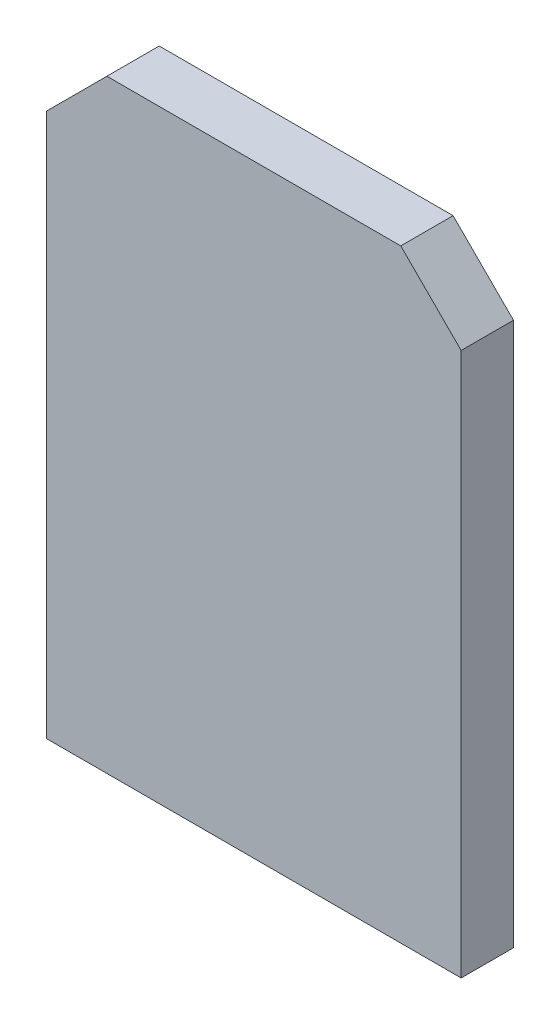
ISO-10303-21;
HEADER;
FILE_DESCRIPTION(('STEP AP214'),'2;1');
FILE_NAME('part.step','',(''),(''),'','','');
FILE_SCHEMA(('AUTOMOTIVE_DESIGN { 1 0 10303 214 1 1 1 1 }'));
ENDSEC;
DATA;
#1=APPLICATION_CONTEXT('core data for automotive mechanical design processes');
#2=APPLICATION_PROTOCOL_DEFINITION('international standard','automotive_design',2000,#1);
#3=PRODUCT_CONTEXT('',#1,'mechanical');
#4=PRODUCT('Part','Part','',(#3));
#5=PRODUCT_RELATED_PRODUCT_CATEGORY('part','',(#4));
#6=PRODUCT_DEFINITION_FORMATION('','',#4);
#7=PRODUCT_DEFINITION_CONTEXT('part definition',#1,'design');
#8=PRODUCT_DEFINITION('design','',#6,#7);
#9=PRODUCT_DEFINITION_SHAPE('','',#8);
#10=(LENGTH_UNIT() NAMED_UNIT(*) SI_UNIT(.MILLI.,.METRE.));
#11=(NAMED_UNIT(*) PLANE_ANGLE_UNIT() SI_UNIT($,.RADIAN.));
#12=(NAMED_UNIT(*) SI_UNIT($,.STERADIAN.) SOLID_ANGLE_UNIT());
#13=UNCERTAINTY_MEASURE_WITH_UNIT(LENGTH_MEASURE(1.E-05),#10,'distance_accuracy_value','');
#14=(GEOMETRIC_REPRESENTATION_CONTEXT(3) GLOBAL_UNCERTAINTY_ASSIGNED_CONTEXT((#13)) GLOBAL_UNIT_ASSIGNED_CONTEXT((#10,
#11,#12)) REPRESENTATION_CONTEXT('',''));
#15=CARTESIAN_POINT('',(0.,0.,0.));
#16=DIRECTION('',(0.,0.,1.));
#17=DIRECTION('',(1.,0.,0.));
#18=AXIS2_PLACEMENT_3D('',#15,#16,#17);
#19=CARTESIAN_POINT('',(-8.94626791893227,-3.08007909045971,1.3));
#20=DIRECTION('',(0.707106781186548,-0.707106781186548,0.));
#21=DIRECTION('',(0.707106781186548,0.707106781186548,0.));
#22=AXIS2_PLACEMENT_3D('',#19,#20,#21);
#23=PLANE('',#22);
#24=DIRECTION('',(-0.707106781186548,-0.707106781186548,0.));
#25=VECTOR('',#24,1.);
#26=CARTESIAN_POINT('',(-8.94626791893227,-3.08007909045971,0.));
#27=LINE('',#26,#25);
#28=CARTESIAN_POINT('',(-8.94626791893227,-3.08007909045971,0.));
#29=VERTEX_POINT('',#28);
#30=CARTESIAN_POINT('',(-10.4462679189323,-4.58007909045971,0.));
#31=VERTEX_POINT('',#30);
#32=EDGE_CURVE('E132',#29,#31,#27,.T.);
#33=ORIENTED_EDGE('',*,*,#32,.T.);
#34=DIRECTION('',(0.,0.,-1.));
#35=VECTOR('',#34,1.);
#36=CARTESIAN_POINT('',(-10.4462679189323,-4.58007909045971,1.3));
#37=LINE('',#36,#35);
#38=CARTESIAN_POINT('',(-10.4462679189323,-4.58007909045971,1.3));
#39=VERTEX_POINT('',#38);
#40=EDGE_CURVE('E11',#39,#31,#37,.T.);
#41=ORIENTED_EDGE('',*,*,#40,.F.);
#42=DIRECTION('',(-0.707106781186548,-0.707106781186548,0.));
#43=VECTOR('',#42,1.);
#44=CARTESIAN_POINT('',(-8.94626791893227,-3.08007909045971,1.3));
#45=LINE('',#44,#43);
#46=CARTESIAN_POINT('',(-8.94626791893227,-3.08007909045971,1.3));
#47=VERTEX_POINT('',#46);
#48=EDGE_CURVE('E151',#47,#39,#45,.T.);
#49=ORIENTED_EDGE('',*,*,#48,.F.);
#50=DIRECTION('',(0.,0.,-1.));
#51=VECTOR('',#50,1.);
#52=CARTESIAN_POINT('',(-8.94626791893227,-3.08007909045971,1.3));
#53=LINE('',#52,#51);
#54=EDGE_CURVE('E60',#47,#29,#53,.T.);
#55=ORIENTED_EDGE('',*,*,#54,.T.);
#56=EDGE_LOOP('',(#33,#41,#49,#55));
#57=FACE_BOUND('',#56,.T.);
#58=ADVANCED_FACE('F43',(#57),#23,.F.);
#59=CARTESIAN_POINT('',(-10.4462679189323,-4.58007909045971,1.3));
#60=DIRECTION('',(1.,0.,0.));
#61=DIRECTION('',(0.,1.,0.));
#62=AXIS2_PLACEMENT_3D('',#59,#60,#61);
#63=PLANE('',#62);
#64=DIRECTION('',(0.,-1.,0.));
#65=VECTOR('',#64,1.);
#66=CARTESIAN_POINT('',(-10.4462679189323,-4.58007909045971,0.));
#67=LINE('',#66,#65);
#68=CARTESIAN_POINT('',(-10.4462679189323,-18.0800790904597,0.));
#69=VERTEX_POINT('',#68);
#70=EDGE_CURVE('E135',#31,#69,#67,.T.);
#71=ORIENTED_EDGE('',*,*,#70,.T.);
#72=DIRECTION('',(0.,0.,-1.));
#73=VECTOR('',#72,1.);
#74=CARTESIAN_POINT('',(-10.4462679189323,-18.0800790904597,1.3));
#75=LINE('',#74,#73);
#76=CARTESIAN_POINT('',(-10.4462679189323,-18.0800790904597,1.3));
#77=VERTEX_POINT('',#76);
#78=EDGE_CURVE('E52',#77,#69,#75,.T.);
#79=ORIENTED_EDGE('',*,*,#78,.F.);
#80=DIRECTION('',(0.,-1.,0.));
#81=VECTOR('',#80,1.);
#82=CARTESIAN_POINT('',(-10.4462679189323,-4.58007909045971,1.3));
#83=LINE('',#82,#81);
#84=EDGE_CURVE('E92',#39,#77,#83,.T.);
#85=ORIENTED_EDGE('',*,*,#84,.F.);
#86=ORIENTED_EDGE('',*,*,#40,.T.);
#87=EDGE_LOOP('',(#71,#79,#85,#86));
#88=FACE_BOUND('',#87,.T.);
#89=ADVANCED_FACE('F175',(#88),#63,.F.);
#90=CARTESIAN_POINT('',(-10.4462679189323,-18.0800790904597,1.3));
#91=DIRECTION('',(0.,1.,0.));
#92=DIRECTION('',(0.,0.,1.));
#93=AXIS2_PLACEMENT_3D('',#90,#91,#92);
#94=PLANE('',#93);
#95=DIRECTION('',(1.,0.,0.));
#96=VECTOR('',#95,1.);
#97=CARTESIAN_POINT('',(-10.4462679189323,-18.0800790904597,0.));
#98=LINE('',#97,#96);
#99=CARTESIAN_POINT('',(-0.146267918932273,-18.0800790904597,0.));
#100=VERTEX_POINT('',#99);
#101=EDGE_CURVE('E138',#69,#100,#98,.T.);
#102=ORIENTED_EDGE('',*,*,#101,.T.);
#103=DIRECTION('',(0.,0.,-1.));
#104=VECTOR('',#103,1.);
#105=CARTESIAN_POINT('',(-0.146267918932273,-18.0800790904597,1.3));
#106=LINE('',#105,#104);
#107=CARTESIAN_POINT('',(-0.146267918932273,-18.0800790904597,1.3));
#108=VERTEX_POINT('',#107);
#109=EDGE_CURVE('E112',#108,#100,#106,.T.);
#110=ORIENTED_EDGE('',*,*,#109,.F.);
#111=DIRECTION('',(1.,0.,0.));
#112=VECTOR('',#111,1.);
#113=CARTESIAN_POINT('',(-10.4462679189323,-18.0800790904597,1.3));
#114=LINE('',#113,#112);
#115=EDGE_CURVE('E120',#77,#108,#114,.T.);
#116=ORIENTED_EDGE('',*,*,#115,.F.);
#117=ORIENTED_EDGE('',*,*,#78,.T.);
#118=EDGE_LOOP('',(#102,#110,#116,#117));
#119=FACE_BOUND('',#118,.T.);
#120=ADVANCED_FACE('F161',(#119),#94,.F.);
#121=CARTESIAN_POINT('',(-0.146267918932274,-4.58007909045971,1.3));
#122=DIRECTION('',(1.,0.,0.));
#123=DIRECTION('',(0.,1.,0.));
#124=AXIS2_PLACEMENT_3D('',#121,#122,#123);
#125=PLANE('',#124);
#126=DIRECTION('',(0.,-1.,0.));
#127=VECTOR('',#126,1.);
#128=CARTESIAN_POINT('',(-0.146267918932274,-4.58007909045971,0.));
#129=LINE('',#128,#127);
#130=CARTESIAN_POINT('',(-0.146267918932274,-4.58007909045971,0.));
#131=VERTEX_POINT('',#130);
#132=EDGE_CURVE('E107',#131,#100,#129,.T.);
#133=ORIENTED_EDGE('',*,*,#132,.F.);
#134=DIRECTION('',(0.,0.,-1.));
#135=VECTOR('',#134,1.);
#136=CARTESIAN_POINT('',(-0.146267918932274,-4.58007909045971,1.3));
#137=LINE('',#136,#135);
#138=CARTESIAN_POINT('',(-0.146267918932274,-4.58007909045971,1.3));
#139=VERTEX_POINT('',#138);
#140=EDGE_CURVE('E102',#139,#131,#137,.T.);
#141=ORIENTED_EDGE('',*,*,#140,.F.);
#142=DIRECTION('',(0.,-1.,0.));
#143=VECTOR('',#142,1.);
#144=CARTESIAN_POINT('',(-0.146267918932274,-4.58007909045971,1.3));
#145=LINE('',#144,#143);
#146=EDGE_CURVE('E105',#139,#108,#145,.T.);
#147=ORIENTED_EDGE('',*,*,#146,.T.);
#148=ORIENTED_EDGE('',*,*,#109,.T.);
#149=EDGE_LOOP('',(#133,#141,#147,#148));
#150=FACE_BOUND('',#149,.T.);
#151=ADVANCED_FACE('F104',(#150),#125,.T.);
#152=CARTESIAN_POINT('',(-1.64626791893227,-3.08007909045971,1.3));
#153=DIRECTION('',(0.707106781186547,0.707106781186548,0.));
#154=DIRECTION('',(-0.707106781186548,0.707106781186547,0.));
#155=AXIS2_PLACEMENT_3D('',#152,#153,#154);
#156=PLANE('',#155);
#157=DIRECTION('',(0.707106781186548,-0.707106781186547,0.));
#158=VECTOR('',#157,1.);
#159=CARTESIAN_POINT('',(-1.64626791893227,-3.08007909045971,0.));
#160=LINE('',#159,#158);
#161=CARTESIAN_POINT('',(-1.64626791893227,-3.08007909045971,0.));
#162=VERTEX_POINT('',#161);
#163=EDGE_CURVE('E144',#162,#131,#160,.T.);
#164=ORIENTED_EDGE('',*,*,#163,.F.);
#165=DIRECTION('',(0.,0.,-1.));
#166=VECTOR('',#165,1.);
#167=CARTESIAN_POINT('',(-1.64626791893227,-3.08007909045971,1.3));
#168=LINE('',#167,#166);
#169=CARTESIAN_POINT('',(-1.64626791893227,-3.08007909045971,1.3));
#170=VERTEX_POINT('',#169);
#171=EDGE_CURVE('E80',#170,#162,#168,.T.);
#172=ORIENTED_EDGE('',*,*,#171,.F.);
#173=DIRECTION('',(0.707106781186548,-0.707106781186547,0.));
#174=VECTOR('',#173,1.);
#175=CARTESIAN_POINT('',(-1.64626791893227,-3.08007909045971,1.3));
#176=LINE('',#175,#174);
#177=EDGE_CURVE('E118',#170,#139,#176,.T.);
#178=ORIENTED_EDGE('',*,*,#177,.T.);
#179=ORIENTED_EDGE('',*,*,#140,.T.);
#180=EDGE_LOOP('',(#164,#172,#178,#179));
#181=FACE_BOUND('',#180,.T.);
#182=ADVANCED_FACE('F124',(#181),#156,.T.);
#183=CARTESIAN_POINT('',(-8.94626791893227,-3.08007909045971,1.3));
#184=DIRECTION('',(0.,1.,0.));
#185=DIRECTION('',(0.,0.,1.));
#186=AXIS2_PLACEMENT_3D('',#183,#184,#185);
#187=PLANE('',#186);
#188=DIRECTION('',(1.,0.,0.));
#189=VECTOR('',#188,1.);
#190=CARTESIAN_POINT('',(-8.94626791893227,-3.08007909045971,0.));
#191=LINE('',#190,#189);
#192=EDGE_CURVE('E147',#29,#162,#191,.T.);
#193=ORIENTED_EDGE('',*,*,#192,.F.);
#194=ORIENTED_EDGE('',*,*,#54,.F.);
#195=DIRECTION('',(1.,0.,0.));
#196=VECTOR('',#195,1.);
#197=CARTESIAN_POINT('',(-8.94626791893227,-3.08007909045971,1.3));
#198=LINE('',#197,#196);
#199=EDGE_CURVE('E126',#47,#170,#198,.T.);
#200=ORIENTED_EDGE('',*,*,#199,.T.);
#201=ORIENTED_EDGE('',*,*,#171,.T.);
#202=EDGE_LOOP('',(#193,#194,#200,#201));
#203=FACE_BOUND('',#202,.T.);
#204=ADVANCED_FACE('F164',(#203),#187,.T.);
#205=CARTESIAN_POINT('',(0.,0.,1.3));
#206=DIRECTION('',(0.,0.,1.));
#207=DIRECTION('',(1.,0.,0.));
#208=AXIS2_PLACEMENT_3D('',#205,#206,#207);
#209=PLANE('',#208);
#210=ORIENTED_EDGE('',*,*,#48,.T.);
#211=ORIENTED_EDGE('',*,*,#84,.T.);
#212=ORIENTED_EDGE('',*,*,#115,.T.);
#213=ORIENTED_EDGE('',*,*,#146,.F.);
#214=ORIENTED_EDGE('',*,*,#177,.F.);
#215=ORIENTED_EDGE('',*,*,#199,.F.);
#216=EDGE_LOOP('',(#210,#211,#212,#213,#214,#215));
#217=FACE_BOUND('',#216,.T.);
#218=ADVANCED_FACE('F116',(#217),#209,.T.);
#219=CARTESIAN_POINT('',(0.,0.,0.));
#220=DIRECTION('',(0.,0.,1.));
#221=DIRECTION('',(1.,0.,0.));
#222=AXIS2_PLACEMENT_3D('',#219,#220,#221);
#223=PLANE('',#222);
#224=ORIENTED_EDGE('',*,*,#32,.F.);
#225=ORIENTED_EDGE('',*,*,#192,.T.);
#226=ORIENTED_EDGE('',*,*,#163,.T.);
#227=ORIENTED_EDGE('',*,*,#132,.T.);
#228=ORIENTED_EDGE('',*,*,#101,.F.);
#229=ORIENTED_EDGE('',*,*,#70,.F.);
#230=EDGE_LOOP('',(#224,#225,#226,#227,#228,#229));
#231=FACE_BOUND('',#230,.T.);
#232=ADVANCED_FACE('F163',(#231),#223,.F.);
#233=CLOSED_SHELL('',(#58,#89,#120,#151,#182,#204,#218,#232));
#234=MANIFOLD_SOLID_BREP('B2',#233);
#235=ADVANCED_BREP_SHAPE_REPRESENTATION('',(#18,#234),#14);
#236=SHAPE_DEFINITION_REPRESENTATION(#9,#235);
ENDSEC;
END-ISO-10303-21;
